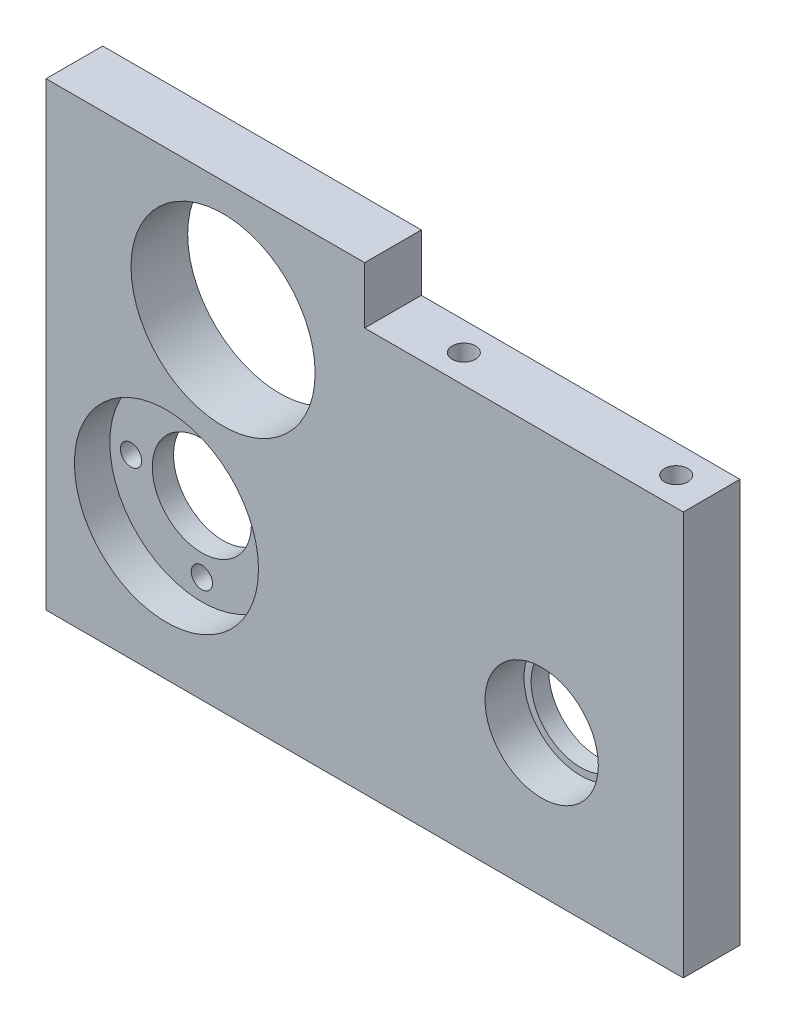
ISO-10303-21;
HEADER;
FILE_DESCRIPTION(('STEP AP214'),'2;1');
FILE_NAME('part.step','',(''),(''),'','','');
FILE_SCHEMA(('AUTOMOTIVE_DESIGN { 1 0 10303 214 1 1 1 1 }'));
ENDSEC;
DATA;
#1=APPLICATION_CONTEXT('core data for automotive mechanical design processes');
#2=APPLICATION_PROTOCOL_DEFINITION('international standard','automotive_design',2000,#1);
#3=PRODUCT_CONTEXT('',#1,'mechanical');
#4=PRODUCT('Part','Part','',(#3));
#5=PRODUCT_RELATED_PRODUCT_CATEGORY('part','',(#4));
#6=PRODUCT_DEFINITION_FORMATION('','',#4);
#7=PRODUCT_DEFINITION_CONTEXT('part definition',#1,'design');
#8=PRODUCT_DEFINITION('design','',#6,#7);
#9=PRODUCT_DEFINITION_SHAPE('','',#8);
#10=(LENGTH_UNIT() NAMED_UNIT(*) SI_UNIT(.MILLI.,.METRE.));
#11=(NAMED_UNIT(*) PLANE_ANGLE_UNIT() SI_UNIT($,.RADIAN.));
#12=(NAMED_UNIT(*) SI_UNIT($,.STERADIAN.) SOLID_ANGLE_UNIT());
#13=UNCERTAINTY_MEASURE_WITH_UNIT(LENGTH_MEASURE(1.E-05),#10,'distance_accuracy_value','');
#14=(GEOMETRIC_REPRESENTATION_CONTEXT(3) GLOBAL_UNCERTAINTY_ASSIGNED_CONTEXT((#13)) GLOBAL_UNIT_ASSIGNED_CONTEXT((#10,
#11,#12)) REPRESENTATION_CONTEXT('',''));
#15=CARTESIAN_POINT('',(0.,0.,0.));
#16=DIRECTION('',(0.,0.,1.));
#17=DIRECTION('',(1.,0.,0.));
#18=AXIS2_PLACEMENT_3D('',#15,#16,#17);
#19=CARTESIAN_POINT('',(70.,20.,8.));
#20=DIRECTION('',(0.,0.,-1.));
#21=DIRECTION('',(-1.,0.,0.));
#22=AXIS2_PLACEMENT_3D('',#19,#20,#21);
#23=CYLINDRICAL_SURFACE('',#22,7.);
#24=CARTESIAN_POINT('',(70.,20.,0.));
#25=DIRECTION('',(0.,0.,1.));
#26=DIRECTION('',(1.,0.,0.));
#27=AXIS2_PLACEMENT_3D('',#24,#25,#26);
#28=CIRCLE('',#27,7.);
#29=CARTESIAN_POINT('',(77.,20.,0.));
#30=VERTEX_POINT('',#29);
#31=EDGE_CURVE('E172',#30,#30,#28,.T.);
#32=ORIENTED_EDGE('',*,*,#31,.F.);
#33=EDGE_LOOP('',(#32));
#34=FACE_BOUND('',#33,.T.);
#35=CARTESIAN_POINT('',(70.,20.,2.5));
#36=DIRECTION('',(0.,0.,1.));
#37=DIRECTION('',(1.,0.,0.));
#38=AXIS2_PLACEMENT_3D('',#35,#36,#37);
#39=CIRCLE('',#38,7.);
#40=CARTESIAN_POINT('',(77.,20.,2.5));
#41=VERTEX_POINT('',#40);
#42=EDGE_CURVE('E36',#41,#41,#39,.T.);
#43=ORIENTED_EDGE('',*,*,#42,.T.);
#44=EDGE_LOOP('',(#43));
#45=FACE_BOUND('',#44,.T.);
#46=ADVANCED_FACE('F32',(#34,#45),#23,.F.);
#47=CARTESIAN_POINT('',(17.,20.,8.));
#48=DIRECTION('',(0.,0.,-1.));
#49=DIRECTION('',(-1.,0.,0.));
#50=AXIS2_PLACEMENT_3D('',#47,#48,#49);
#51=CYLINDRICAL_SURFACE('',#50,13.);
#52=CARTESIAN_POINT('',(17.,20.,8.));
#53=DIRECTION('',(0.,0.,1.));
#54=DIRECTION('',(1.,0.,0.));
#55=AXIS2_PLACEMENT_3D('',#52,#53,#54);
#56=CIRCLE('',#55,13.);
#57=CARTESIAN_POINT('',(30.,20.,8.));
#58=VERTEX_POINT('',#57);
#59=EDGE_CURVE('E167',#58,#58,#56,.T.);
#60=ORIENTED_EDGE('',*,*,#59,.T.);
#61=EDGE_LOOP('',(#60));
#62=FACE_BOUND('',#61,.T.);
#63=CARTESIAN_POINT('',(17.,20.,3.));
#64=DIRECTION('',(0.,0.,-1.));
#65=DIRECTION('',(-1.,0.,0.));
#66=AXIS2_PLACEMENT_3D('',#63,#64,#65);
#67=CIRCLE('',#66,13.);
#68=CARTESIAN_POINT('',(4.00000000000001,20.,3.));
#69=VERTEX_POINT('',#68);
#70=EDGE_CURVE('E158',#69,#69,#67,.T.);
#71=ORIENTED_EDGE('',*,*,#70,.T.);
#72=EDGE_LOOP('',(#71));
#73=FACE_BOUND('',#72,.T.);
#74=ADVANCED_FACE('F204',(#62,#73),#51,.F.);
#75=CARTESIAN_POINT('',(0.,0.,8.));
#76=DIRECTION('',(0.,0.,-1.));
#77=DIRECTION('',(-1.,0.,0.));
#78=AXIS2_PLACEMENT_3D('',#75,#76,#77);
#79=PLANE('',#78);
#80=CARTESIAN_POINT('',(70.,20.,8.));
#81=DIRECTION('',(0.,0.,1.));
#82=DIRECTION('',(1.,0.,0.));
#83=AXIS2_PLACEMENT_3D('',#80,#81,#82);
#84=CIRCLE('',#83,8.00000000000001);
#85=CARTESIAN_POINT('',(78.,20.,8.));
#86=VERTEX_POINT('',#85);
#87=EDGE_CURVE('E123',#86,#86,#84,.T.);
#88=ORIENTED_EDGE('',*,*,#87,.F.);
#89=EDGE_LOOP('',(#88));
#90=FACE_BOUND('',#89,.T.);
#91=DIRECTION('',(1.,0.,0.));
#92=VECTOR('',#91,1.);
#93=CARTESIAN_POINT('',(45.,57.,8.));
#94=LINE('',#93,#92);
#95=CARTESIAN_POINT('',(45.,57.,8.));
#96=VERTEX_POINT('',#95);
#97=CARTESIAN_POINT('',(90.,57.,8.));
#98=VERTEX_POINT('',#97);
#99=EDGE_CURVE('E112',#96,#98,#94,.T.);
#100=ORIENTED_EDGE('',*,*,#99,.F.);
#101=DIRECTION('',(0.,-1.,0.));
#102=VECTOR('',#101,1.);
#103=CARTESIAN_POINT('',(45.,65.,8.));
#104=LINE('',#103,#102);
#105=CARTESIAN_POINT('',(45.,65.,8.));
#106=VERTEX_POINT('',#105);
#107=EDGE_CURVE('E96',#106,#96,#104,.T.);
#108=ORIENTED_EDGE('',*,*,#107,.F.);
#109=DIRECTION('',(-1.,0.,0.));
#110=VECTOR('',#109,1.);
#111=CARTESIAN_POINT('',(0.,65.,8.));
#112=LINE('',#111,#110);
#113=CARTESIAN_POINT('',(0.,65.,8.));
#114=VERTEX_POINT('',#113);
#115=EDGE_CURVE('E57',#106,#114,#112,.T.);
#116=ORIENTED_EDGE('',*,*,#115,.T.);
#117=DIRECTION('',(0.,-1.,0.));
#118=VECTOR('',#117,1.);
#119=CARTESIAN_POINT('',(0.,0.,8.));
#120=LINE('',#119,#118);
#121=CARTESIAN_POINT('',(0.,0.,8.));
#122=VERTEX_POINT('',#121);
#123=EDGE_CURVE('E176',#114,#122,#120,.T.);
#124=ORIENTED_EDGE('',*,*,#123,.T.);
#125=DIRECTION('',(1.,0.,0.));
#126=VECTOR('',#125,1.);
#127=CARTESIAN_POINT('',(0.,0.,8.));
#128=LINE('',#127,#126);
#129=CARTESIAN_POINT('',(90.,0.,8.));
#130=VERTEX_POINT('',#129);
#131=EDGE_CURVE('E79',#122,#130,#128,.T.);
#132=ORIENTED_EDGE('',*,*,#131,.T.);
#133=DIRECTION('',(0.,1.,0.));
#134=VECTOR('',#133,1.);
#135=CARTESIAN_POINT('',(90.,0.,8.));
#136=LINE('',#135,#134);
#137=EDGE_CURVE('E179',#130,#98,#136,.T.);
#138=ORIENTED_EDGE('',*,*,#137,.T.);
#139=EDGE_LOOP('',(#100,#108,#116,#124,#132,#138));
#140=FACE_BOUND('',#139,.T.);
#141=ORIENTED_EDGE('',*,*,#59,.F.);
#142=EDGE_LOOP('',(#141));
#143=FACE_BOUND('',#142,.T.);
#144=CARTESIAN_POINT('',(25.,48.,8.));
#145=DIRECTION('',(0.,0.,1.));
#146=DIRECTION('',(1.,0.,0.));
#147=AXIS2_PLACEMENT_3D('',#144,#145,#146);
#148=CIRCLE('',#147,13.);
#149=CARTESIAN_POINT('',(38.,48.,8.));
#150=VERTEX_POINT('',#149);
#151=EDGE_CURVE('E164',#150,#150,#148,.T.);
#152=ORIENTED_EDGE('',*,*,#151,.F.);
#153=EDGE_LOOP('',(#152));
#154=FACE_BOUND('',#153,.T.);
#155=ADVANCED_FACE('F201',(#90,#140,#143,#154),#79,.F.);
#156=CARTESIAN_POINT('',(0.,0.,0.));
#157=DIRECTION('',(0.,0.,-1.));
#158=DIRECTION('',(-1.,0.,0.));
#159=AXIS2_PLACEMENT_3D('',#156,#157,#158);
#160=PLANE('',#159);
#161=DIRECTION('',(0.,-1.,0.));
#162=VECTOR('',#161,1.);
#163=CARTESIAN_POINT('',(45.,65.,0.));
#164=LINE('',#163,#162);
#165=CARTESIAN_POINT('',(45.,65.,0.));
#166=VERTEX_POINT('',#165);
#167=CARTESIAN_POINT('',(45.,57.,0.));
#168=VERTEX_POINT('',#167);
#169=EDGE_CURVE('E48',#166,#168,#164,.T.);
#170=ORIENTED_EDGE('',*,*,#169,.T.);
#171=DIRECTION('',(1.,0.,0.));
#172=VECTOR('',#171,1.);
#173=CARTESIAN_POINT('',(45.,57.,0.));
#174=LINE('',#173,#172);
#175=CARTESIAN_POINT('',(90.,57.,0.));
#176=VERTEX_POINT('',#175);
#177=EDGE_CURVE('E100',#168,#176,#174,.T.);
#178=ORIENTED_EDGE('',*,*,#177,.T.);
#179=DIRECTION('',(0.,1.,0.));
#180=VECTOR('',#179,1.);
#181=CARTESIAN_POINT('',(90.,0.,0.));
#182=LINE('',#181,#180);
#183=CARTESIAN_POINT('',(90.,0.,0.));
#184=VERTEX_POINT('',#183);
#185=EDGE_CURVE('E188',#184,#176,#182,.T.);
#186=ORIENTED_EDGE('',*,*,#185,.F.);
#187=DIRECTION('',(1.,0.,0.));
#188=VECTOR('',#187,1.);
#189=CARTESIAN_POINT('',(0.,0.,0.));
#190=LINE('',#189,#188);
#191=CARTESIAN_POINT('',(0.,0.,0.));
#192=VERTEX_POINT('',#191);
#193=EDGE_CURVE('E186',#192,#184,#190,.T.);
#194=ORIENTED_EDGE('',*,*,#193,.F.);
#195=DIRECTION('',(0.,-1.,0.));
#196=VECTOR('',#195,1.);
#197=CARTESIAN_POINT('',(0.,0.,0.));
#198=LINE('',#197,#196);
#199=CARTESIAN_POINT('',(0.,65.,0.));
#200=VERTEX_POINT('',#199);
#201=EDGE_CURVE('E175',#200,#192,#198,.T.);
#202=ORIENTED_EDGE('',*,*,#201,.F.);
#203=DIRECTION('',(-1.,0.,0.));
#204=VECTOR('',#203,1.);
#205=CARTESIAN_POINT('',(0.,65.,0.));
#206=LINE('',#205,#204);
#207=EDGE_CURVE('E74',#166,#200,#206,.T.);
#208=ORIENTED_EDGE('',*,*,#207,.F.);
#209=EDGE_LOOP('',(#170,#178,#186,#194,#202,#208));
#210=FACE_BOUND('',#209,.T.);
#211=CARTESIAN_POINT('',(17.,30.,0.));
#212=DIRECTION('',(0.,0.,1.));
#213=DIRECTION('',(1.,0.,0.));
#214=AXIS2_PLACEMENT_3D('',#211,#212,#213);
#215=CIRCLE('',#214,1.5);
#216=CARTESIAN_POINT('',(18.5,30.,0.));
#217=VERTEX_POINT('',#216);
#218=EDGE_CURVE('E137',#217,#217,#215,.T.);
#219=ORIENTED_EDGE('',*,*,#218,.T.);
#220=EDGE_LOOP('',(#219));
#221=FACE_BOUND('',#220,.T.);
#222=CARTESIAN_POINT('',(7.00000000000001,20.,0.));
#223=DIRECTION('',(0.,0.,1.));
#224=DIRECTION('',(1.,0.,0.));
#225=AXIS2_PLACEMENT_3D('',#222,#223,#224);
#226=CIRCLE('',#225,1.5);
#227=CARTESIAN_POINT('',(8.50000000000001,20.,0.));
#228=VERTEX_POINT('',#227);
#229=EDGE_CURVE('E130',#228,#228,#226,.T.);
#230=ORIENTED_EDGE('',*,*,#229,.T.);
#231=EDGE_LOOP('',(#230));
#232=FACE_BOUND('',#231,.T.);
#233=CARTESIAN_POINT('',(17.,10.,0.));
#234=DIRECTION('',(0.,0.,1.));
#235=DIRECTION('',(1.,0.,0.));
#236=AXIS2_PLACEMENT_3D('',#233,#234,#235);
#237=CIRCLE('',#236,1.5);
#238=CARTESIAN_POINT('',(18.5,10.,0.));
#239=VERTEX_POINT('',#238);
#240=EDGE_CURVE('E150',#239,#239,#237,.T.);
#241=ORIENTED_EDGE('',*,*,#240,.T.);
#242=EDGE_LOOP('',(#241));
#243=FACE_BOUND('',#242,.T.);
#244=CARTESIAN_POINT('',(27.,20.,0.));
#245=DIRECTION('',(0.,0.,1.));
#246=DIRECTION('',(1.,0.,0.));
#247=AXIS2_PLACEMENT_3D('',#244,#245,#246);
#248=CIRCLE('',#247,1.5);
#249=CARTESIAN_POINT('',(28.5,20.,0.));
#250=VERTEX_POINT('',#249);
#251=EDGE_CURVE('E143',#250,#250,#248,.T.);
#252=ORIENTED_EDGE('',*,*,#251,.T.);
#253=EDGE_LOOP('',(#252));
#254=FACE_BOUND('',#253,.T.);
#255=CARTESIAN_POINT('',(17.,20.,0.));
#256=DIRECTION('',(0.,0.,1.));
#257=DIRECTION('',(1.,0.,0.));
#258=AXIS2_PLACEMENT_3D('',#255,#256,#257);
#259=CIRCLE('',#258,7.);
#260=CARTESIAN_POINT('',(24.,20.,0.));
#261=VERTEX_POINT('',#260);
#262=EDGE_CURVE('E155',#261,#261,#259,.T.);
#263=ORIENTED_EDGE('',*,*,#262,.T.);
#264=EDGE_LOOP('',(#263));
#265=FACE_BOUND('',#264,.T.);
#266=ORIENTED_EDGE('',*,*,#31,.T.);
#267=EDGE_LOOP('',(#266));
#268=FACE_BOUND('',#267,.T.);
#269=CARTESIAN_POINT('',(25.,48.,0.));
#270=DIRECTION('',(0.,0.,1.));
#271=DIRECTION('',(1.,0.,0.));
#272=AXIS2_PLACEMENT_3D('',#269,#270,#271);
#273=CIRCLE('',#272,13.);
#274=CARTESIAN_POINT('',(38.,48.,0.));
#275=VERTEX_POINT('',#274);
#276=EDGE_CURVE('E163',#275,#275,#273,.T.);
#277=ORIENTED_EDGE('',*,*,#276,.T.);
#278=EDGE_LOOP('',(#277));
#279=FACE_BOUND('',#278,.T.);
#280=ADVANCED_FACE('F109',(#210,#221,#232,#243,#254,#265,#268,#279),#160,.T.);
#281=CARTESIAN_POINT('',(0.,0.,8.));
#282=DIRECTION('',(1.,0.,0.));
#283=DIRECTION('',(0.,0.,-1.));
#284=AXIS2_PLACEMENT_3D('',#281,#282,#283);
#285=PLANE('',#284);
#286=CARTESIAN_POINT('',(0.,45.,4.));
#287=DIRECTION('',(-1.,0.,0.));
#288=DIRECTION('',(0.,0.,1.));
#289=AXIS2_PLACEMENT_3D('',#286,#287,#288);
#290=CIRCLE('',#289,1.65);
#291=CARTESIAN_POINT('',(0.,45.,5.65));
#292=VERTEX_POINT('',#291);
#293=EDGE_CURVE('E318',#292,#292,#290,.T.);
#294=ORIENTED_EDGE('',*,*,#293,.F.);
#295=EDGE_LOOP('',(#294));
#296=FACE_BOUND('',#295,.T.);
#297=CARTESIAN_POINT('',(0.,7.,4.));
#298=DIRECTION('',(-1.,0.,0.));
#299=DIRECTION('',(0.,0.,1.));
#300=AXIS2_PLACEMENT_3D('',#297,#298,#299);
#301=CIRCLE('',#300,1.65);
#302=CARTESIAN_POINT('',(0.,7.,5.65));
#303=VERTEX_POINT('',#302);
#304=EDGE_CURVE('E116',#303,#303,#301,.T.);
#305=ORIENTED_EDGE('',*,*,#304,.F.);
#306=EDGE_LOOP('',(#305));
#307=FACE_BOUND('',#306,.T.);
#308=ORIENTED_EDGE('',*,*,#201,.T.);
#309=DIRECTION('',(0.,0.,-1.));
#310=VECTOR('',#309,1.);
#311=CARTESIAN_POINT('',(0.,0.,8.));
#312=LINE('',#311,#310);
#313=EDGE_CURVE('E11',#122,#192,#312,.T.);
#314=ORIENTED_EDGE('',*,*,#313,.F.);
#315=ORIENTED_EDGE('',*,*,#123,.F.);
#316=DIRECTION('',(0.,0.,-1.));
#317=VECTOR('',#316,1.);
#318=CARTESIAN_POINT('',(0.,65.,8.));
#319=LINE('',#318,#317);
#320=EDGE_CURVE('E183',#114,#200,#319,.T.);
#321=ORIENTED_EDGE('',*,*,#320,.T.);
#322=EDGE_LOOP('',(#308,#314,#315,#321));
#323=FACE_BOUND('',#322,.T.);
#324=ADVANCED_FACE('F34',(#296,#307,#323),#285,.F.);
#325=CARTESIAN_POINT('',(0.,0.,8.));
#326=DIRECTION('',(0.,1.,0.));
#327=DIRECTION('',(0.,0.,1.));
#328=AXIS2_PLACEMENT_3D('',#325,#326,#327);
#329=PLANE('',#328);
#330=ORIENTED_EDGE('',*,*,#193,.T.);
#331=DIRECTION('',(0.,0.,-1.));
#332=VECTOR('',#331,1.);
#333=CARTESIAN_POINT('',(90.,0.,8.));
#334=LINE('',#333,#332);
#335=EDGE_CURVE('E41',#130,#184,#334,.T.);
#336=ORIENTED_EDGE('',*,*,#335,.F.);
#337=ORIENTED_EDGE('',*,*,#131,.F.);
#338=ORIENTED_EDGE('',*,*,#313,.T.);
#339=EDGE_LOOP('',(#330,#336,#337,#338));
#340=FACE_BOUND('',#339,.T.);
#341=ADVANCED_FACE('F197',(#340),#329,.F.);
#342=CARTESIAN_POINT('',(90.,0.,8.));
#343=DIRECTION('',(-1.,0.,0.));
#344=DIRECTION('',(0.,0.,1.));
#345=AXIS2_PLACEMENT_3D('',#342,#343,#344);
#346=PLANE('',#345);
#347=ORIENTED_EDGE('',*,*,#185,.T.);
#348=DIRECTION('',(0.,0.,1.));
#349=VECTOR('',#348,1.);
#350=CARTESIAN_POINT('',(90.,57.,0.));
#351=LINE('',#350,#349);
#352=EDGE_CURVE('E99',#176,#98,#351,.T.);
#353=ORIENTED_EDGE('',*,*,#352,.T.);
#354=ORIENTED_EDGE('',*,*,#137,.F.);
#355=ORIENTED_EDGE('',*,*,#335,.T.);
#356=EDGE_LOOP('',(#347,#353,#354,#355));
#357=FACE_BOUND('',#356,.T.);
#358=ADVANCED_FACE('F195',(#357),#346,.F.);
#359=CARTESIAN_POINT('',(0.,65.,8.));
#360=DIRECTION('',(0.,-1.,0.));
#361=DIRECTION('',(0.,0.,-1.));
#362=AXIS2_PLACEMENT_3D('',#359,#360,#361);
#363=PLANE('',#362);
#364=ORIENTED_EDGE('',*,*,#115,.F.);
#365=DIRECTION('',(0.,0.,1.));
#366=VECTOR('',#365,1.);
#367=CARTESIAN_POINT('',(45.,65.,0.));
#368=LINE('',#367,#366);
#369=EDGE_CURVE('E121',#166,#106,#368,.T.);
#370=ORIENTED_EDGE('',*,*,#369,.F.);
#371=ORIENTED_EDGE('',*,*,#207,.T.);
#372=ORIENTED_EDGE('',*,*,#320,.F.);
#373=EDGE_LOOP('',(#364,#370,#371,#372));
#374=FACE_BOUND('',#373,.T.);
#375=ADVANCED_FACE('F200',(#374),#363,.F.);
#376=CARTESIAN_POINT('',(25.,48.,8.));
#377=DIRECTION('',(0.,0.,-1.));
#378=DIRECTION('',(-1.,0.,0.));
#379=AXIS2_PLACEMENT_3D('',#376,#377,#378);
#380=CYLINDRICAL_SURFACE('',#379,13.);
#381=ORIENTED_EDGE('',*,*,#151,.T.);
#382=EDGE_LOOP('',(#381));
#383=FACE_BOUND('',#382,.T.);
#384=ORIENTED_EDGE('',*,*,#276,.F.);
#385=EDGE_LOOP('',(#384));
#386=FACE_BOUND('',#385,.T.);
#387=ADVANCED_FACE('F211',(#383,#386),#380,.F.);
#388=CARTESIAN_POINT('',(17.,20.,3.));
#389=DIRECTION('',(0.,0.,-1.));
#390=DIRECTION('',(-1.,0.,0.));
#391=AXIS2_PLACEMENT_3D('',#388,#389,#390);
#392=PLANE('',#391);
#393=CARTESIAN_POINT('',(17.,30.,3.));
#394=DIRECTION('',(0.,0.,1.));
#395=DIRECTION('',(1.,0.,0.));
#396=AXIS2_PLACEMENT_3D('',#393,#394,#395);
#397=CIRCLE('',#396,1.5);
#398=CARTESIAN_POINT('',(18.5,30.,3.));
#399=VERTEX_POINT('',#398);
#400=EDGE_CURVE('E140',#399,#399,#397,.T.);
#401=ORIENTED_EDGE('',*,*,#400,.F.);
#402=EDGE_LOOP('',(#401));
#403=FACE_BOUND('',#402,.T.);
#404=CARTESIAN_POINT('',(7.00000000000001,20.,3.));
#405=DIRECTION('',(0.,0.,1.));
#406=DIRECTION('',(1.,0.,0.));
#407=AXIS2_PLACEMENT_3D('',#404,#405,#406);
#408=CIRCLE('',#407,1.5);
#409=CARTESIAN_POINT('',(8.50000000000001,20.,3.));
#410=VERTEX_POINT('',#409);
#411=EDGE_CURVE('E134',#410,#410,#408,.T.);
#412=ORIENTED_EDGE('',*,*,#411,.F.);
#413=EDGE_LOOP('',(#412));
#414=FACE_BOUND('',#413,.T.);
#415=CARTESIAN_POINT('',(17.,10.,3.));
#416=DIRECTION('',(0.,0.,1.));
#417=DIRECTION('',(1.,0.,0.));
#418=AXIS2_PLACEMENT_3D('',#415,#416,#417);
#419=CIRCLE('',#418,1.5);
#420=CARTESIAN_POINT('',(18.5,10.,3.));
#421=VERTEX_POINT('',#420);
#422=EDGE_CURVE('E133',#421,#421,#419,.T.);
#423=ORIENTED_EDGE('',*,*,#422,.F.);
#424=EDGE_LOOP('',(#423));
#425=FACE_BOUND('',#424,.T.);
#426=CARTESIAN_POINT('',(27.,20.,3.));
#427=DIRECTION('',(0.,0.,1.));
#428=DIRECTION('',(1.,0.,0.));
#429=AXIS2_PLACEMENT_3D('',#426,#427,#428);
#430=CIRCLE('',#429,1.5);
#431=CARTESIAN_POINT('',(28.5,20.,3.));
#432=VERTEX_POINT('',#431);
#433=EDGE_CURVE('E147',#432,#432,#430,.T.);
#434=ORIENTED_EDGE('',*,*,#433,.F.);
#435=EDGE_LOOP('',(#434));
#436=FACE_BOUND('',#435,.T.);
#437=CARTESIAN_POINT('',(17.,20.,3.));
#438=DIRECTION('',(0.,0.,1.));
#439=DIRECTION('',(1.,0.,0.));
#440=AXIS2_PLACEMENT_3D('',#437,#438,#439);
#441=CIRCLE('',#440,7.);
#442=CARTESIAN_POINT('',(24.,20.,3.));
#443=VERTEX_POINT('',#442);
#444=EDGE_CURVE('E146',#443,#443,#441,.T.);
#445=ORIENTED_EDGE('',*,*,#444,.F.);
#446=EDGE_LOOP('',(#445));
#447=FACE_BOUND('',#446,.T.);
#448=ORIENTED_EDGE('',*,*,#70,.F.);
#449=EDGE_LOOP('',(#448));
#450=FACE_BOUND('',#449,.T.);
#451=ADVANCED_FACE('F214',(#403,#414,#425,#436,#447,#450),#392,.F.);
#452=CARTESIAN_POINT('',(17.,20.,0.));
#453=DIRECTION('',(0.,0.,1.));
#454=DIRECTION('',(1.,0.,0.));
#455=AXIS2_PLACEMENT_3D('',#452,#453,#454);
#456=CYLINDRICAL_SURFACE('',#455,7.);
#457=ORIENTED_EDGE('',*,*,#262,.F.);
#458=EDGE_LOOP('',(#457));
#459=FACE_BOUND('',#458,.T.);
#460=ORIENTED_EDGE('',*,*,#444,.T.);
#461=EDGE_LOOP('',(#460));
#462=FACE_BOUND('',#461,.T.);
#463=ADVANCED_FACE('F238',(#459,#462),#456,.F.);
#464=CARTESIAN_POINT('',(27.,20.,0.));
#465=DIRECTION('',(0.,0.,1.));
#466=DIRECTION('',(1.,0.,0.));
#467=AXIS2_PLACEMENT_3D('',#464,#465,#466);
#468=CYLINDRICAL_SURFACE('',#467,1.5);
#469=ORIENTED_EDGE('',*,*,#251,.F.);
#470=EDGE_LOOP('',(#469));
#471=FACE_BOUND('',#470,.T.);
#472=ORIENTED_EDGE('',*,*,#433,.T.);
#473=EDGE_LOOP('',(#472));
#474=FACE_BOUND('',#473,.T.);
#475=ADVANCED_FACE('F242',(#471,#474),#468,.F.);
#476=CARTESIAN_POINT('',(17.,10.,0.));
#477=DIRECTION('',(0.,0.,1.));
#478=DIRECTION('',(1.,0.,0.));
#479=AXIS2_PLACEMENT_3D('',#476,#477,#478);
#480=CYLINDRICAL_SURFACE('',#479,1.5);
#481=ORIENTED_EDGE('',*,*,#240,.F.);
#482=EDGE_LOOP('',(#481));
#483=FACE_BOUND('',#482,.T.);
#484=ORIENTED_EDGE('',*,*,#422,.T.);
#485=EDGE_LOOP('',(#484));
#486=FACE_BOUND('',#485,.T.);
#487=ADVANCED_FACE('F244',(#483,#486),#480,.F.);
#488=CARTESIAN_POINT('',(7.00000000000001,20.,0.));
#489=DIRECTION('',(0.,0.,1.));
#490=DIRECTION('',(1.,0.,0.));
#491=AXIS2_PLACEMENT_3D('',#488,#489,#490);
#492=CYLINDRICAL_SURFACE('',#491,1.5);
#493=ORIENTED_EDGE('',*,*,#229,.F.);
#494=EDGE_LOOP('',(#493));
#495=FACE_BOUND('',#494,.T.);
#496=ORIENTED_EDGE('',*,*,#411,.T.);
#497=EDGE_LOOP('',(#496));
#498=FACE_BOUND('',#497,.T.);
#499=ADVANCED_FACE('F247',(#495,#498),#492,.F.);
#500=CARTESIAN_POINT('',(17.,30.,0.));
#501=DIRECTION('',(0.,0.,1.));
#502=DIRECTION('',(1.,0.,0.));
#503=AXIS2_PLACEMENT_3D('',#500,#501,#502);
#504=CYLINDRICAL_SURFACE('',#503,1.5);
#505=ORIENTED_EDGE('',*,*,#218,.F.);
#506=EDGE_LOOP('',(#505));
#507=FACE_BOUND('',#506,.T.);
#508=ORIENTED_EDGE('',*,*,#400,.T.);
#509=EDGE_LOOP('',(#508));
#510=FACE_BOUND('',#509,.T.);
#511=ADVANCED_FACE('F252',(#507,#510),#504,.F.);
#512=CARTESIAN_POINT('',(70.,20.,2.5));
#513=DIRECTION('',(0.,0.,1.));
#514=DIRECTION('',(1.,0.,0.));
#515=AXIS2_PLACEMENT_3D('',#512,#513,#514);
#516=CYLINDRICAL_SURFACE('',#515,8.00000000000001);
#517=CARTESIAN_POINT('',(70.,20.,2.5));
#518=DIRECTION('',(0.,0.,1.));
#519=DIRECTION('',(1.,0.,0.));
#520=AXIS2_PLACEMENT_3D('',#517,#518,#519);
#521=CIRCLE('',#520,8.00000000000001);
#522=CARTESIAN_POINT('',(78.,20.,2.5));
#523=VERTEX_POINT('',#522);
#524=EDGE_CURVE('E125',#523,#523,#521,.T.);
#525=ORIENTED_EDGE('',*,*,#524,.F.);
#526=EDGE_LOOP('',(#525));
#527=FACE_BOUND('',#526,.T.);
#528=ORIENTED_EDGE('',*,*,#87,.T.);
#529=EDGE_LOOP('',(#528));
#530=FACE_BOUND('',#529,.T.);
#531=ADVANCED_FACE('F255',(#527,#530),#516,.F.);
#532=CARTESIAN_POINT('',(70.,20.,2.5));
#533=DIRECTION('',(0.,0.,1.));
#534=DIRECTION('',(1.,0.,0.));
#535=AXIS2_PLACEMENT_3D('',#532,#533,#534);
#536=PLANE('',#535);
#537=ORIENTED_EDGE('',*,*,#42,.F.);
#538=EDGE_LOOP('',(#537));
#539=FACE_BOUND('',#538,.T.);
#540=ORIENTED_EDGE('',*,*,#524,.T.);
#541=EDGE_LOOP('',(#540));
#542=FACE_BOUND('',#541,.T.);
#543=ADVANCED_FACE('F262',(#539,#542),#536,.T.);
#544=CARTESIAN_POINT('',(45.,65.,0.));
#545=DIRECTION('',(-1.,0.,0.));
#546=DIRECTION('',(0.,0.,1.));
#547=AXIS2_PLACEMENT_3D('',#544,#545,#546);
#548=PLANE('',#547);
#549=ORIENTED_EDGE('',*,*,#107,.T.);
#550=DIRECTION('',(0.,0.,1.));
#551=VECTOR('',#550,1.);
#552=CARTESIAN_POINT('',(45.,57.,0.));
#553=LINE('',#552,#551);
#554=EDGE_CURVE('E93',#168,#96,#553,.T.);
#555=ORIENTED_EDGE('',*,*,#554,.F.);
#556=ORIENTED_EDGE('',*,*,#169,.F.);
#557=ORIENTED_EDGE('',*,*,#369,.T.);
#558=EDGE_LOOP('',(#549,#555,#556,#557));
#559=FACE_BOUND('',#558,.T.);
#560=ADVANCED_FACE('F95',(#559),#548,.F.);
#561=CARTESIAN_POINT('',(45.,57.,0.));
#562=DIRECTION('',(0.,-1.,0.));
#563=DIRECTION('',(0.,0.,-1.));
#564=AXIS2_PLACEMENT_3D('',#561,#562,#563);
#565=PLANE('',#564);
#566=CARTESIAN_POINT('',(55.,57.,4.));
#567=DIRECTION('',(0.,1.,0.));
#568=DIRECTION('',(0.,0.,1.));
#569=AXIS2_PLACEMENT_3D('',#566,#567,#568);
#570=CIRCLE('',#569,1.65);
#571=CARTESIAN_POINT('',(55.,57.,5.65));
#572=VERTEX_POINT('',#571);
#573=EDGE_CURVE('E309',#572,#572,#570,.T.);
#574=ORIENTED_EDGE('',*,*,#573,.F.);
#575=EDGE_LOOP('',(#574));
#576=FACE_BOUND('',#575,.T.);
#577=CARTESIAN_POINT('',(85.,57.,4.));
#578=DIRECTION('',(0.,1.,0.));
#579=DIRECTION('',(0.,0.,1.));
#580=AXIS2_PLACEMENT_3D('',#577,#578,#579);
#581=CIRCLE('',#580,1.65);
#582=CARTESIAN_POINT('',(85.,57.,5.65));
#583=VERTEX_POINT('',#582);
#584=EDGE_CURVE('E308',#583,#583,#581,.T.);
#585=ORIENTED_EDGE('',*,*,#584,.F.);
#586=EDGE_LOOP('',(#585));
#587=FACE_BOUND('',#586,.T.);
#588=ORIENTED_EDGE('',*,*,#99,.T.);
#589=ORIENTED_EDGE('',*,*,#352,.F.);
#590=ORIENTED_EDGE('',*,*,#177,.F.);
#591=ORIENTED_EDGE('',*,*,#554,.T.);
#592=EDGE_LOOP('',(#588,#589,#590,#591));
#593=FACE_BOUND('',#592,.T.);
#594=ADVANCED_FACE('F103',(#576,#587,#593),#565,.F.);
#595=CARTESIAN_POINT('',(10.,7.,4.));
#596=DIRECTION('',(-1.,0.,0.));
#597=DIRECTION('',(0.,0.,1.));
#598=AXIS2_PLACEMENT_3D('',#595,#596,#597);
#599=CYLINDRICAL_SURFACE('',#598,1.65);
#600=CARTESIAN_POINT('',(10.,7.,4.));
#601=DIRECTION('',(-1.,0.,0.));
#602=DIRECTION('',(0.,0.,1.));
#603=AXIS2_PLACEMENT_3D('',#600,#601,#602);
#604=CIRCLE('',#603,1.65);
#605=CARTESIAN_POINT('',(10.,7.,5.65));
#606=VERTEX_POINT('',#605);
#607=EDGE_CURVE('E119',#606,#606,#604,.T.);
#608=ORIENTED_EDGE('',*,*,#607,.F.);
#609=EDGE_LOOP('',(#608));
#610=FACE_BOUND('',#609,.T.);
#611=ORIENTED_EDGE('',*,*,#304,.T.);
#612=EDGE_LOOP('',(#611));
#613=FACE_BOUND('',#612,.T.);
#614=ADVANCED_FACE('F271',(#610,#613),#599,.F.);
#615=CARTESIAN_POINT('',(10.,7.,4.));
#616=DIRECTION('',(-1.,0.,0.));
#617=DIRECTION('',(0.,0.,1.));
#618=AXIS2_PLACEMENT_3D('',#615,#616,#617);
#619=PLANE('',#618);
#620=ORIENTED_EDGE('',*,*,#607,.T.);
#621=EDGE_LOOP('',(#620));
#622=FACE_BOUND('',#621,.T.);
#623=ADVANCED_FACE('F275',(#622),#619,.T.);
#624=CARTESIAN_POINT('',(10.,45.,4.));
#625=DIRECTION('',(-1.,0.,0.));
#626=DIRECTION('',(0.,0.,1.));
#627=AXIS2_PLACEMENT_3D('',#624,#625,#626);
#628=CYLINDRICAL_SURFACE('',#627,1.65);
#629=CARTESIAN_POINT('',(10.,45.,4.));
#630=DIRECTION('',(-1.,0.,0.));
#631=DIRECTION('',(0.,0.,1.));
#632=AXIS2_PLACEMENT_3D('',#629,#630,#631);
#633=CIRCLE('',#632,1.65);
#634=CARTESIAN_POINT('',(10.,45.,5.65));
#635=VERTEX_POINT('',#634);
#636=EDGE_CURVE('E320',#635,#635,#633,.T.);
#637=ORIENTED_EDGE('',*,*,#636,.F.);
#638=EDGE_LOOP('',(#637));
#639=FACE_BOUND('',#638,.T.);
#640=ORIENTED_EDGE('',*,*,#293,.T.);
#641=EDGE_LOOP('',(#640));
#642=FACE_BOUND('',#641,.T.);
#643=ADVANCED_FACE('F279',(#639,#642),#628,.F.);
#644=CARTESIAN_POINT('',(10.,45.,4.));
#645=DIRECTION('',(-1.,0.,0.));
#646=DIRECTION('',(0.,0.,1.));
#647=AXIS2_PLACEMENT_3D('',#644,#645,#646);
#648=PLANE('',#647);
#649=ORIENTED_EDGE('',*,*,#636,.T.);
#650=EDGE_LOOP('',(#649));
#651=FACE_BOUND('',#650,.T.);
#652=ADVANCED_FACE('F283',(#651),#648,.T.);
#653=CARTESIAN_POINT('',(85.,47.,4.));
#654=DIRECTION('',(0.,1.,0.));
#655=DIRECTION('',(0.,0.,1.));
#656=AXIS2_PLACEMENT_3D('',#653,#654,#655);
#657=CYLINDRICAL_SURFACE('',#656,1.65);
#658=CARTESIAN_POINT('',(85.,47.,4.));
#659=DIRECTION('',(0.,1.,0.));
#660=DIRECTION('',(0.,0.,1.));
#661=AXIS2_PLACEMENT_3D('',#658,#659,#660);
#662=CIRCLE('',#661,1.65);
#663=CARTESIAN_POINT('',(85.,47.,5.65));
#664=VERTEX_POINT('',#663);
#665=EDGE_CURVE('E312',#664,#664,#662,.T.);
#666=ORIENTED_EDGE('',*,*,#665,.F.);
#667=EDGE_LOOP('',(#666));
#668=FACE_BOUND('',#667,.T.);
#669=ORIENTED_EDGE('',*,*,#584,.T.);
#670=EDGE_LOOP('',(#669));
#671=FACE_BOUND('',#670,.T.);
#672=ADVANCED_FACE('F287',(#668,#671),#657,.F.);
#673=CARTESIAN_POINT('',(85.,47.,4.));
#674=DIRECTION('',(0.,1.,0.));
#675=DIRECTION('',(0.,0.,1.));
#676=AXIS2_PLACEMENT_3D('',#673,#674,#675);
#677=PLANE('',#676);
#678=ORIENTED_EDGE('',*,*,#665,.T.);
#679=EDGE_LOOP('',(#678));
#680=FACE_BOUND('',#679,.T.);
#681=ADVANCED_FACE('F291',(#680),#677,.T.);
#682=CARTESIAN_POINT('',(55.,47.,4.));
#683=DIRECTION('',(0.,1.,0.));
#684=DIRECTION('',(0.,0.,1.));
#685=AXIS2_PLACEMENT_3D('',#682,#683,#684);
#686=CYLINDRICAL_SURFACE('',#685,1.65);
#687=CARTESIAN_POINT('',(55.,47.,4.));
#688=DIRECTION('',(0.,1.,0.));
#689=DIRECTION('',(0.,0.,1.));
#690=AXIS2_PLACEMENT_3D('',#687,#688,#689);
#691=CIRCLE('',#690,1.65);
#692=CARTESIAN_POINT('',(55.,47.,5.65));
#693=VERTEX_POINT('',#692);
#694=EDGE_CURVE('E307',#693,#693,#691,.T.);
#695=ORIENTED_EDGE('',*,*,#694,.F.);
#696=EDGE_LOOP('',(#695));
#697=FACE_BOUND('',#696,.T.);
#698=ORIENTED_EDGE('',*,*,#573,.T.);
#699=EDGE_LOOP('',(#698));
#700=FACE_BOUND('',#699,.T.);
#701=ADVANCED_FACE('F295',(#697,#700),#686,.F.);
#702=CARTESIAN_POINT('',(55.,47.,4.));
#703=DIRECTION('',(0.,1.,0.));
#704=DIRECTION('',(0.,0.,1.));
#705=AXIS2_PLACEMENT_3D('',#702,#703,#704);
#706=PLANE('',#705);
#707=ORIENTED_EDGE('',*,*,#694,.T.);
#708=EDGE_LOOP('',(#707));
#709=FACE_BOUND('',#708,.T.);
#710=ADVANCED_FACE('F299',(#709),#706,.T.);
#711=CLOSED_SHELL('',(#46,#74,#155,#280,#324,#341,#358,#375,#387,#451,#463,#475,#487,#499,#511,
#531,#543,#560,#594,#614,#623,#643,#652,#672,#681,#701,#710));
#712=MANIFOLD_SOLID_BREP('B2',#711);
#713=ADVANCED_BREP_SHAPE_REPRESENTATION('',(#18,#712),#14);
#714=SHAPE_DEFINITION_REPRESENTATION(#9,#713);
ENDSEC;
END-ISO-10303-21;
